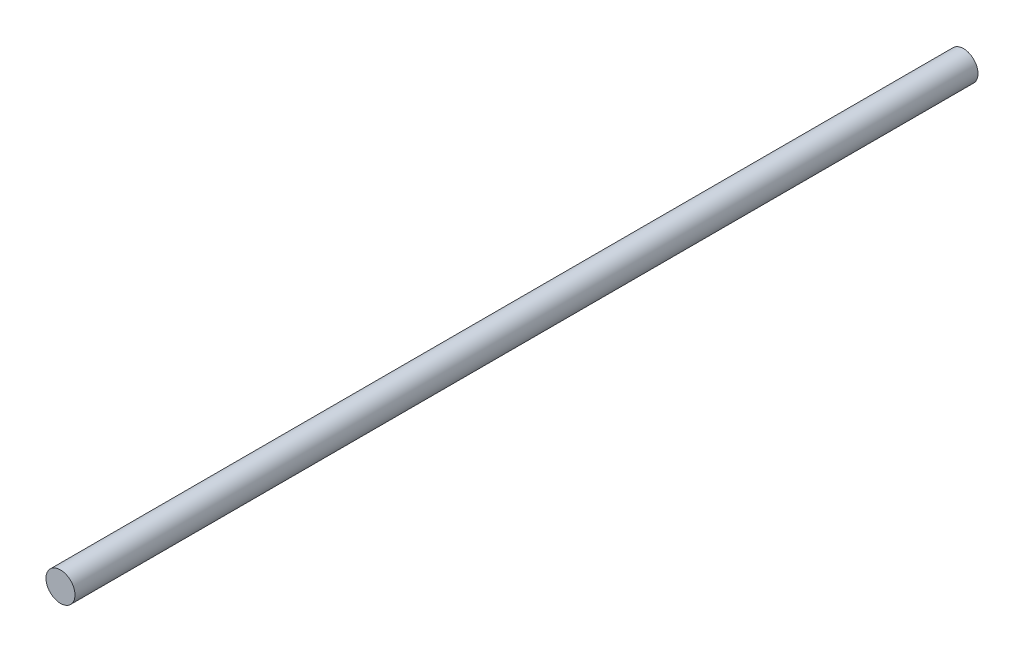
ISO-10303-21;
HEADER;
FILE_DESCRIPTION(('STEP AP214'),'2;1');
FILE_NAME('part.step','',(''),(''),'','','');
FILE_SCHEMA(('AUTOMOTIVE_DESIGN { 1 0 10303 214 1 1 1 1 }'));
ENDSEC;
DATA;
#1=APPLICATION_CONTEXT('core data for automotive mechanical design processes');
#2=APPLICATION_PROTOCOL_DEFINITION('international standard','automotive_design',2000,#1);
#3=PRODUCT_CONTEXT('',#1,'mechanical');
#4=PRODUCT('Part','Part','',(#3));
#5=PRODUCT_RELATED_PRODUCT_CATEGORY('part','',(#4));
#6=PRODUCT_DEFINITION_FORMATION('','',#4);
#7=PRODUCT_DEFINITION_CONTEXT('part definition',#1,'design');
#8=PRODUCT_DEFINITION('design','',#6,#7);
#9=PRODUCT_DEFINITION_SHAPE('','',#8);
#10=(LENGTH_UNIT() NAMED_UNIT(*) SI_UNIT(.MILLI.,.METRE.));
#11=(NAMED_UNIT(*) PLANE_ANGLE_UNIT() SI_UNIT($,.RADIAN.));
#12=(NAMED_UNIT(*) SI_UNIT($,.STERADIAN.) SOLID_ANGLE_UNIT());
#13=UNCERTAINTY_MEASURE_WITH_UNIT(LENGTH_MEASURE(1.E-05),#10,'distance_accuracy_value','');
#14=(GEOMETRIC_REPRESENTATION_CONTEXT(3) GLOBAL_UNCERTAINTY_ASSIGNED_CONTEXT((#13)) GLOBAL_UNIT_ASSIGNED_CONTEXT((#10,
#11,#12)) REPRESENTATION_CONTEXT('',''));
#15=CARTESIAN_POINT('',(0.,0.,0.));
#16=DIRECTION('',(0.,0.,1.));
#17=DIRECTION('',(1.,0.,0.));
#18=AXIS2_PLACEMENT_3D('',#15,#16,#17);
#19=CARTESIAN_POINT('',(0.,0.,101.6));
#20=DIRECTION('',(0.,0.,-1.));
#21=DIRECTION('',(-1.,0.,0.));
#22=AXIS2_PLACEMENT_3D('',#19,#20,#21);
#23=CYLINDRICAL_SURFACE('',#22,1.63195);
#24=CARTESIAN_POINT('',(0.,0.,101.6));
#25=DIRECTION('',(0.,0.,1.));
#26=DIRECTION('',(1.,0.,0.));
#27=AXIS2_PLACEMENT_3D('',#24,#25,#26);
#28=CIRCLE('',#27,1.63195);
#29=CARTESIAN_POINT('',(1.63195,0.,101.6));
#30=VERTEX_POINT('',#29);
#31=EDGE_CURVE('E10',#30,#30,#28,.T.);
#32=ORIENTED_EDGE('',*,*,#31,.F.);
#33=EDGE_LOOP('',(#32));
#34=FACE_BOUND('',#33,.T.);
#35=CARTESIAN_POINT('',(0.,0.,0.));
#36=DIRECTION('',(0.,0.,1.));
#37=DIRECTION('',(1.,0.,0.));
#38=AXIS2_PLACEMENT_3D('',#35,#36,#37);
#39=CIRCLE('',#38,1.63195);
#40=CARTESIAN_POINT('',(1.63195,0.,0.));
#41=VERTEX_POINT('',#40);
#42=EDGE_CURVE('E34',#41,#41,#39,.T.);
#43=ORIENTED_EDGE('',*,*,#42,.T.);
#44=EDGE_LOOP('',(#43));
#45=FACE_BOUND('',#44,.T.);
#46=ADVANCED_FACE('F31',(#34,#45),#23,.T.);
#47=CARTESIAN_POINT('',(0.,0.,101.6));
#48=DIRECTION('',(0.,0.,1.));
#49=DIRECTION('',(1.,0.,0.));
#50=AXIS2_PLACEMENT_3D('',#47,#48,#49);
#51=PLANE('',#50);
#52=ORIENTED_EDGE('',*,*,#31,.T.);
#53=EDGE_LOOP('',(#52));
#54=FACE_BOUND('',#53,.T.);
#55=ADVANCED_FACE('F46',(#54),#51,.T.);
#56=CARTESIAN_POINT('',(0.,0.,0.));
#57=DIRECTION('',(0.,0.,1.));
#58=DIRECTION('',(1.,0.,0.));
#59=AXIS2_PLACEMENT_3D('',#56,#57,#58);
#60=PLANE('',#59);
#61=ORIENTED_EDGE('',*,*,#42,.F.);
#62=EDGE_LOOP('',(#61));
#63=FACE_BOUND('',#62,.T.);
#64=ADVANCED_FACE('F44',(#63),#60,.F.);
#65=CLOSED_SHELL('',(#46,#55,#64));
#66=MANIFOLD_SOLID_BREP('B2',#65);
#67=ADVANCED_BREP_SHAPE_REPRESENTATION('',(#18,#66),#14);
#68=SHAPE_DEFINITION_REPRESENTATION(#9,#67);
ENDSEC;
END-ISO-10303-21;
